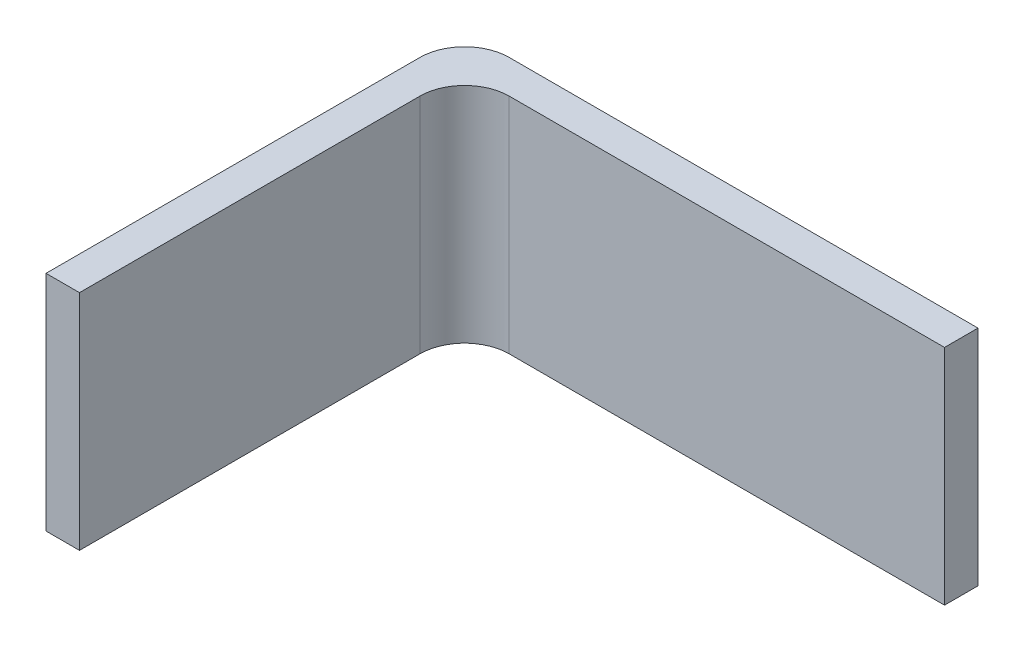
ISO-10303-21;
HEADER;
FILE_DESCRIPTION(('STEP AP214'),'2;1');
FILE_NAME('part.step','',(''),(''),'','','');
FILE_SCHEMA(('AUTOMOTIVE_DESIGN { 1 0 10303 214 1 1 1 1 }'));
ENDSEC;
DATA;
#1=APPLICATION_CONTEXT('core data for automotive mechanical design processes');
#2=APPLICATION_PROTOCOL_DEFINITION('international standard','automotive_design',2000,#1);
#3=PRODUCT_CONTEXT('',#1,'mechanical');
#4=PRODUCT('Part','Part','',(#3));
#5=PRODUCT_RELATED_PRODUCT_CATEGORY('part','',(#4));
#6=PRODUCT_DEFINITION_FORMATION('','',#4);
#7=PRODUCT_DEFINITION_CONTEXT('part definition',#1,'design');
#8=PRODUCT_DEFINITION('design','',#6,#7);
#9=PRODUCT_DEFINITION_SHAPE('','',#8);
#10=(LENGTH_UNIT() NAMED_UNIT(*) SI_UNIT(.MILLI.,.METRE.));
#11=(NAMED_UNIT(*) PLANE_ANGLE_UNIT() SI_UNIT($,.RADIAN.));
#12=(NAMED_UNIT(*) SI_UNIT($,.STERADIAN.) SOLID_ANGLE_UNIT());
#13=UNCERTAINTY_MEASURE_WITH_UNIT(LENGTH_MEASURE(1.E-05),#10,'distance_accuracy_value','');
#14=(GEOMETRIC_REPRESENTATION_CONTEXT(3) GLOBAL_UNCERTAINTY_ASSIGNED_CONTEXT((#13)) GLOBAL_UNIT_ASSIGNED_CONTEXT((#10,
#11,#12)) REPRESENTATION_CONTEXT('',''));
#15=CARTESIAN_POINT('',(0.,0.,0.));
#16=DIRECTION('',(0.,0.,1.));
#17=DIRECTION('',(1.,0.,0.));
#18=AXIS2_PLACEMENT_3D('',#15,#16,#17);
#19=CARTESIAN_POINT('',(6.00000000000001,40.,75.));
#20=DIRECTION('',(0.,0.,-1.));
#21=DIRECTION('',(-1.,0.,0.));
#22=AXIS2_PLACEMENT_3D('',#19,#20,#21);
#23=PLANE('',#22);
#24=DIRECTION('',(1.,0.,0.));
#25=VECTOR('',#24,1.);
#26=CARTESIAN_POINT('',(6.00000000000001,0.,75.));
#27=LINE('',#26,#25);
#28=CARTESIAN_POINT('',(0.,0.,75.));
#29=VERTEX_POINT('',#28);
#30=CARTESIAN_POINT('',(6.00000000000001,0.,75.));
#31=VERTEX_POINT('',#30);
#32=EDGE_CURVE('E133',#29,#31,#27,.T.);
#33=ORIENTED_EDGE('',*,*,#32,.T.);
#34=DIRECTION('',(0.,-1.,0.));
#35=VECTOR('',#34,1.);
#36=CARTESIAN_POINT('',(6.00000000000001,40.,75.));
#37=LINE('',#36,#35);
#38=CARTESIAN_POINT('',(6.00000000000001,40.,75.));
#39=VERTEX_POINT('',#38);
#40=EDGE_CURVE('E11',#39,#31,#37,.T.);
#41=ORIENTED_EDGE('',*,*,#40,.F.);
#42=DIRECTION('',(1.,0.,0.));
#43=VECTOR('',#42,1.);
#44=CARTESIAN_POINT('',(6.00000000000001,40.,75.));
#45=LINE('',#44,#43);
#46=CARTESIAN_POINT('',(0.,40.,75.));
#47=VERTEX_POINT('',#46);
#48=EDGE_CURVE('E147',#47,#39,#45,.T.);
#49=ORIENTED_EDGE('',*,*,#48,.F.);
#50=DIRECTION('',(0.,-1.,0.));
#51=VECTOR('',#50,1.);
#52=CARTESIAN_POINT('',(0.,40.,75.));
#53=LINE('',#52,#51);
#54=EDGE_CURVE('E129',#47,#29,#53,.T.);
#55=ORIENTED_EDGE('',*,*,#54,.T.);
#56=EDGE_LOOP('',(#33,#41,#49,#55));
#57=FACE_BOUND('',#56,.T.);
#58=ADVANCED_FACE('F37',(#57),#23,.F.);
#59=CARTESIAN_POINT('',(6.,40.,14.));
#60=DIRECTION('',(-1.,0.,0.));
#61=DIRECTION('',(0.,0.,1.));
#62=AXIS2_PLACEMENT_3D('',#59,#60,#61);
#63=PLANE('',#62);
#64=DIRECTION('',(0.,0.,-1.));
#65=VECTOR('',#64,1.);
#66=CARTESIAN_POINT('',(6.,0.,14.));
#67=LINE('',#66,#65);
#68=CARTESIAN_POINT('',(6.,0.,14.));
#69=VERTEX_POINT('',#68);
#70=EDGE_CURVE('E136',#31,#69,#67,.T.);
#71=ORIENTED_EDGE('',*,*,#70,.T.);
#72=DIRECTION('',(0.,-1.,0.));
#73=VECTOR('',#72,1.);
#74=CARTESIAN_POINT('',(6.,40.,14.));
#75=LINE('',#74,#73);
#76=CARTESIAN_POINT('',(6.,40.,14.));
#77=VERTEX_POINT('',#76);
#78=EDGE_CURVE('E45',#77,#69,#75,.T.);
#79=ORIENTED_EDGE('',*,*,#78,.F.);
#80=DIRECTION('',(0.,0.,-1.));
#81=VECTOR('',#80,1.);
#82=CARTESIAN_POINT('',(6.,40.,14.));
#83=LINE('',#82,#81);
#84=EDGE_CURVE('E96',#39,#77,#83,.T.);
#85=ORIENTED_EDGE('',*,*,#84,.F.);
#86=ORIENTED_EDGE('',*,*,#40,.T.);
#87=EDGE_LOOP('',(#71,#79,#85,#86));
#88=FACE_BOUND('',#87,.T.);
#89=ADVANCED_FACE('F182',(#88),#63,.F.);
#90=CARTESIAN_POINT('',(14.,40.,14.));
#91=DIRECTION('',(0.,-1.,0.));
#92=DIRECTION('',(0.,0.,-1.));
#93=AXIS2_PLACEMENT_3D('',#90,#91,#92);
#94=CYLINDRICAL_SURFACE('',#93,8.);
#95=CARTESIAN_POINT('',(14.,0.,14.));
#96=DIRECTION('',(0.,-1.,0.));
#97=DIRECTION('',(0.,0.,1.));
#98=AXIS2_PLACEMENT_3D('',#95,#96,#97);
#99=CIRCLE('',#98,8.);
#100=CARTESIAN_POINT('',(14.,0.,6.00000000000001));
#101=VERTEX_POINT('',#100);
#102=EDGE_CURVE('E138',#69,#101,#99,.T.);
#103=ORIENTED_EDGE('',*,*,#102,.T.);
#104=DIRECTION('',(0.,-1.,0.));
#105=VECTOR('',#104,1.);
#106=CARTESIAN_POINT('',(14.,40.,6.00000000000001));
#107=LINE('',#106,#105);
#108=CARTESIAN_POINT('',(14.,40.,6.00000000000001));
#109=VERTEX_POINT('',#108);
#110=EDGE_CURVE('E154',#109,#101,#107,.T.);
#111=ORIENTED_EDGE('',*,*,#110,.F.);
#112=CARTESIAN_POINT('',(14.,40.,14.));
#113=DIRECTION('',(0.,-1.,0.));
#114=DIRECTION('',(0.,0.,1.));
#115=AXIS2_PLACEMENT_3D('',#112,#113,#114);
#116=CIRCLE('',#115,8.);
#117=EDGE_CURVE('E162',#77,#109,#116,.T.);
#118=ORIENTED_EDGE('',*,*,#117,.F.);
#119=ORIENTED_EDGE('',*,*,#78,.T.);
#120=EDGE_LOOP('',(#103,#111,#118,#119));
#121=FACE_BOUND('',#120,.T.);
#122=ADVANCED_FACE('F160',(#121),#94,.F.);
#123=CARTESIAN_POINT('',(92.,40.,6.));
#124=DIRECTION('',(0.,0.,-1.));
#125=DIRECTION('',(-1.,0.,0.));
#126=AXIS2_PLACEMENT_3D('',#123,#124,#125);
#127=PLANE('',#126);
#128=DIRECTION('',(1.,0.,0.));
#129=VECTOR('',#128,1.);
#130=CARTESIAN_POINT('',(92.,0.,6.));
#131=LINE('',#130,#129);
#132=CARTESIAN_POINT('',(92.,0.,6.));
#133=VERTEX_POINT('',#132);
#134=EDGE_CURVE('E140',#101,#133,#131,.T.);
#135=ORIENTED_EDGE('',*,*,#134,.T.);
#136=DIRECTION('',(0.,-1.,0.));
#137=VECTOR('',#136,1.);
#138=CARTESIAN_POINT('',(92.,40.,6.));
#139=LINE('',#138,#137);
#140=CARTESIAN_POINT('',(92.,40.,6.));
#141=VERTEX_POINT('',#140);
#142=EDGE_CURVE('E151',#141,#133,#139,.T.);
#143=ORIENTED_EDGE('',*,*,#142,.F.);
#144=DIRECTION('',(1.,0.,0.));
#145=VECTOR('',#144,1.);
#146=CARTESIAN_POINT('',(92.,40.,6.));
#147=LINE('',#146,#145);
#148=EDGE_CURVE('E174',#109,#141,#147,.T.);
#149=ORIENTED_EDGE('',*,*,#148,.F.);
#150=ORIENTED_EDGE('',*,*,#110,.T.);
#151=EDGE_LOOP('',(#135,#143,#149,#150));
#152=FACE_BOUND('',#151,.T.);
#153=ADVANCED_FACE('F170',(#152),#127,.F.);
#154=CARTESIAN_POINT('',(92.,40.,0.));
#155=DIRECTION('',(-1.,0.,0.));
#156=DIRECTION('',(0.,0.,1.));
#157=AXIS2_PLACEMENT_3D('',#154,#155,#156);
#158=PLANE('',#157);
#159=DIRECTION('',(0.,0.,-1.));
#160=VECTOR('',#159,1.);
#161=CARTESIAN_POINT('',(92.,0.,0.));
#162=LINE('',#161,#160);
#163=CARTESIAN_POINT('',(92.,0.,0.));
#164=VERTEX_POINT('',#163);
#165=EDGE_CURVE('E142',#133,#164,#162,.T.);
#166=ORIENTED_EDGE('',*,*,#165,.T.);
#167=DIRECTION('',(0.,-1.,0.));
#168=VECTOR('',#167,1.);
#169=CARTESIAN_POINT('',(92.,40.,0.));
#170=LINE('',#169,#168);
#171=CARTESIAN_POINT('',(92.,40.,0.));
#172=VERTEX_POINT('',#171);
#173=EDGE_CURVE('E124',#172,#164,#170,.T.);
#174=ORIENTED_EDGE('',*,*,#173,.F.);
#175=DIRECTION('',(0.,0.,-1.));
#176=VECTOR('',#175,1.);
#177=CARTESIAN_POINT('',(92.,40.,0.));
#178=LINE('',#177,#176);
#179=EDGE_CURVE('E115',#141,#172,#178,.T.);
#180=ORIENTED_EDGE('',*,*,#179,.F.);
#181=ORIENTED_EDGE('',*,*,#142,.T.);
#182=EDGE_LOOP('',(#166,#174,#180,#181));
#183=FACE_BOUND('',#182,.T.);
#184=ADVANCED_FACE('F173',(#183),#158,.F.);
#185=CARTESIAN_POINT('',(8.00000000000006,40.,0.));
#186=DIRECTION('',(0.,0.,1.));
#187=DIRECTION('',(1.,0.,0.));
#188=AXIS2_PLACEMENT_3D('',#185,#186,#187);
#189=PLANE('',#188);
#190=DIRECTION('',(-1.,0.,0.));
#191=VECTOR('',#190,1.);
#192=CARTESIAN_POINT('',(8.00000000000006,0.,0.));
#193=LINE('',#192,#191);
#194=CARTESIAN_POINT('',(8.00000000000006,0.,0.));
#195=VERTEX_POINT('',#194);
#196=EDGE_CURVE('E123',#164,#195,#193,.T.);
#197=ORIENTED_EDGE('',*,*,#196,.T.);
#198=DIRECTION('',(0.,-1.,0.));
#199=VECTOR('',#198,1.);
#200=CARTESIAN_POINT('',(8.00000000000006,40.,0.));
#201=LINE('',#200,#199);
#202=CARTESIAN_POINT('',(8.00000000000006,40.,0.));
#203=VERTEX_POINT('',#202);
#204=EDGE_CURVE('E120',#203,#195,#201,.T.);
#205=ORIENTED_EDGE('',*,*,#204,.F.);
#206=DIRECTION('',(-1.,0.,0.));
#207=VECTOR('',#206,1.);
#208=CARTESIAN_POINT('',(8.00000000000006,40.,0.));
#209=LINE('',#208,#207);
#210=EDGE_CURVE('E109',#172,#203,#209,.T.);
#211=ORIENTED_EDGE('',*,*,#210,.F.);
#212=ORIENTED_EDGE('',*,*,#173,.T.);
#213=EDGE_LOOP('',(#197,#205,#211,#212));
#214=FACE_BOUND('',#213,.T.);
#215=ADVANCED_FACE('F121',(#214),#189,.F.);
#216=CARTESIAN_POINT('',(8.,40.,8.));
#217=DIRECTION('',(0.,-1.,0.));
#218=DIRECTION('',(0.,0.,-1.));
#219=AXIS2_PLACEMENT_3D('',#216,#217,#218);
#220=CYLINDRICAL_SURFACE('',#219,8.);
#221=CARTESIAN_POINT('',(8.,0.,8.));
#222=DIRECTION('',(0.,1.,0.));
#223=DIRECTION('',(0.,0.,-1.));
#224=AXIS2_PLACEMENT_3D('',#221,#222,#223);
#225=CIRCLE('',#224,8.);
#226=CARTESIAN_POINT('',(0.,0.,8.00000000000006));
#227=VERTEX_POINT('',#226);
#228=EDGE_CURVE('E82',#195,#227,#225,.T.);
#229=ORIENTED_EDGE('',*,*,#228,.T.);
#230=DIRECTION('',(0.,-1.,0.));
#231=VECTOR('',#230,1.);
#232=CARTESIAN_POINT('',(0.,40.,8.00000000000006));
#233=LINE('',#232,#231);
#234=CARTESIAN_POINT('',(0.,40.,8.00000000000006));
#235=VERTEX_POINT('',#234);
#236=EDGE_CURVE('E125',#235,#227,#233,.T.);
#237=ORIENTED_EDGE('',*,*,#236,.F.);
#238=CARTESIAN_POINT('',(8.,40.,8.));
#239=DIRECTION('',(0.,1.,0.));
#240=DIRECTION('',(0.,0.,-1.));
#241=AXIS2_PLACEMENT_3D('',#238,#239,#240);
#242=CIRCLE('',#241,8.);
#243=EDGE_CURVE('E113',#203,#235,#242,.T.);
#244=ORIENTED_EDGE('',*,*,#243,.F.);
#245=ORIENTED_EDGE('',*,*,#204,.T.);
#246=EDGE_LOOP('',(#229,#237,#244,#245));
#247=FACE_BOUND('',#246,.T.);
#248=ADVANCED_FACE('F127',(#247),#220,.T.);
#249=CARTESIAN_POINT('',(0.,40.,8.00000000000006));
#250=DIRECTION('',(1.,0.,0.));
#251=DIRECTION('',(0.,0.,-1.));
#252=AXIS2_PLACEMENT_3D('',#249,#250,#251);
#253=PLANE('',#252);
#254=DIRECTION('',(0.,0.,1.));
#255=VECTOR('',#254,1.);
#256=CARTESIAN_POINT('',(0.,0.,8.00000000000006));
#257=LINE('',#256,#255);
#258=EDGE_CURVE('E88',#227,#29,#257,.T.);
#259=ORIENTED_EDGE('',*,*,#258,.T.);
#260=ORIENTED_EDGE('',*,*,#54,.F.);
#261=DIRECTION('',(0.,0.,1.));
#262=VECTOR('',#261,1.);
#263=CARTESIAN_POINT('',(0.,40.,8.00000000000006));
#264=LINE('',#263,#262);
#265=EDGE_CURVE('E53',#235,#47,#264,.T.);
#266=ORIENTED_EDGE('',*,*,#265,.F.);
#267=ORIENTED_EDGE('',*,*,#236,.T.);
#268=EDGE_LOOP('',(#259,#260,#266,#267));
#269=FACE_BOUND('',#268,.T.);
#270=ADVANCED_FACE('F198',(#269),#253,.F.);
#271=CARTESIAN_POINT('',(8.,40.,8.));
#272=DIRECTION('',(0.,-1.,0.));
#273=DIRECTION('',(0.,0.,-1.));
#274=AXIS2_PLACEMENT_3D('',#271,#272,#273);
#275=PLANE('',#274);
#276=ORIENTED_EDGE('',*,*,#48,.T.);
#277=ORIENTED_EDGE('',*,*,#84,.T.);
#278=ORIENTED_EDGE('',*,*,#117,.T.);
#279=ORIENTED_EDGE('',*,*,#148,.T.);
#280=ORIENTED_EDGE('',*,*,#179,.T.);
#281=ORIENTED_EDGE('',*,*,#210,.T.);
#282=ORIENTED_EDGE('',*,*,#243,.T.);
#283=ORIENTED_EDGE('',*,*,#265,.T.);
#284=EDGE_LOOP('',(#276,#277,#278,#279,#280,#281,#282,#283));
#285=FACE_BOUND('',#284,.T.);
#286=ADVANCED_FACE('F111',(#285),#275,.F.);
#287=CARTESIAN_POINT('',(8.,0.,8.));
#288=DIRECTION('',(0.,-1.,0.));
#289=DIRECTION('',(0.,0.,-1.));
#290=AXIS2_PLACEMENT_3D('',#287,#288,#289);
#291=PLANE('',#290);
#292=ORIENTED_EDGE('',*,*,#32,.F.);
#293=ORIENTED_EDGE('',*,*,#258,.F.);
#294=ORIENTED_EDGE('',*,*,#228,.F.);
#295=ORIENTED_EDGE('',*,*,#196,.F.);
#296=ORIENTED_EDGE('',*,*,#165,.F.);
#297=ORIENTED_EDGE('',*,*,#134,.F.);
#298=ORIENTED_EDGE('',*,*,#102,.F.);
#299=ORIENTED_EDGE('',*,*,#70,.F.);
#300=EDGE_LOOP('',(#292,#293,#294,#295,#296,#297,#298,#299));
#301=FACE_BOUND('',#300,.T.);
#302=ADVANCED_FACE('F166',(#301),#291,.T.);
#303=CLOSED_SHELL('',(#58,#89,#122,#153,#184,#215,#248,#270,#286,#302));
#304=MANIFOLD_SOLID_BREP('B2',#303);
#305=ADVANCED_BREP_SHAPE_REPRESENTATION('',(#18,#304),#14);
#306=SHAPE_DEFINITION_REPRESENTATION(#9,#305);
ENDSEC;
END-ISO-10303-21;
